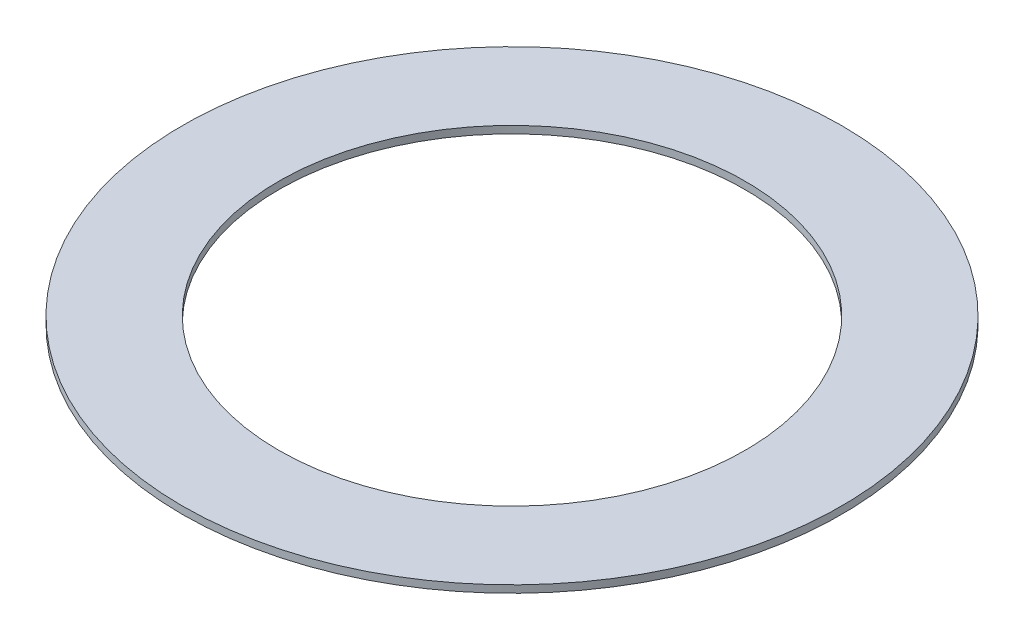
ISO-10303-21;
HEADER;
FILE_DESCRIPTION(('STEP AP214'),'2;1');
FILE_NAME('part.step','',(''),(''),'','','');
FILE_SCHEMA(('AUTOMOTIVE_DESIGN { 1 0 10303 214 1 1 1 1 }'));
ENDSEC;
DATA;
#1=APPLICATION_CONTEXT('core data for automotive mechanical design processes');
#2=APPLICATION_PROTOCOL_DEFINITION('international standard','automotive_design',2000,#1);
#3=PRODUCT_CONTEXT('',#1,'mechanical');
#4=PRODUCT('Part','Part','',(#3));
#5=PRODUCT_RELATED_PRODUCT_CATEGORY('part','',(#4));
#6=PRODUCT_DEFINITION_FORMATION('','',#4);
#7=PRODUCT_DEFINITION_CONTEXT('part definition',#1,'design');
#8=PRODUCT_DEFINITION('design','',#6,#7);
#9=PRODUCT_DEFINITION_SHAPE('','',#8);
#10=(LENGTH_UNIT() NAMED_UNIT(*) SI_UNIT(.MILLI.,.METRE.));
#11=(NAMED_UNIT(*) PLANE_ANGLE_UNIT() SI_UNIT($,.RADIAN.));
#12=(NAMED_UNIT(*) SI_UNIT($,.STERADIAN.) SOLID_ANGLE_UNIT());
#13=UNCERTAINTY_MEASURE_WITH_UNIT(LENGTH_MEASURE(1.E-05),#10,'distance_accuracy_value','');
#14=(GEOMETRIC_REPRESENTATION_CONTEXT(3) GLOBAL_UNCERTAINTY_ASSIGNED_CONTEXT((#13)) GLOBAL_UNIT_ASSIGNED_CONTEXT((#10,
#11,#12)) REPRESENTATION_CONTEXT('',''));
#15=CARTESIAN_POINT('',(0.,0.,0.));
#16=DIRECTION('',(0.,0.,1.));
#17=DIRECTION('',(1.,0.,0.));
#18=AXIS2_PLACEMENT_3D('',#15,#16,#17);
#19=CARTESIAN_POINT('',(0.,2.4,0.));
#20=DIRECTION('',(0.,1.,0.));
#21=DIRECTION('',(0.,0.,1.));
#22=AXIS2_PLACEMENT_3D('',#19,#20,#21);
#23=PLANE('',#22);
#24=CARTESIAN_POINT('',(0.,2.4,0.));
#25=DIRECTION('',(0.,1.,0.));
#26=DIRECTION('',(0.,0.,1.));
#27=AXIS2_PLACEMENT_3D('',#24,#25,#26);
#28=CIRCLE('',#27,107.696);
#29=CARTESIAN_POINT('',(0.,2.4,107.696));
#30=VERTEX_POINT('',#29);
#31=EDGE_CURVE('E10',#30,#30,#28,.T.);
#32=ORIENTED_EDGE('',*,*,#31,.T.);
#33=EDGE_LOOP('',(#32));
#34=FACE_BOUND('',#33,.T.);
#35=CARTESIAN_POINT('',(0.,2.4,0.));
#36=DIRECTION('',(0.,1.,0.));
#37=DIRECTION('',(0.,0.,1.));
#38=AXIS2_PLACEMENT_3D('',#35,#36,#37);
#39=CIRCLE('',#38,76.2);
#40=CARTESIAN_POINT('',(0.,2.4,76.2));
#41=VERTEX_POINT('',#40);
#42=EDGE_CURVE('E43',#41,#41,#39,.T.);
#43=ORIENTED_EDGE('',*,*,#42,.F.);
#44=EDGE_LOOP('',(#43));
#45=FACE_BOUND('',#44,.T.);
#46=ADVANCED_FACE('F32',(#34,#45),#23,.T.);
#47=CARTESIAN_POINT('',(0.,0.,0.));
#48=DIRECTION('',(0.,1.,0.));
#49=DIRECTION('',(0.,0.,1.));
#50=AXIS2_PLACEMENT_3D('',#47,#48,#49);
#51=PLANE('',#50);
#52=CARTESIAN_POINT('',(0.,0.,0.));
#53=DIRECTION('',(0.,1.,0.));
#54=DIRECTION('',(0.,0.,1.));
#55=AXIS2_PLACEMENT_3D('',#52,#53,#54);
#56=CIRCLE('',#55,107.696);
#57=CARTESIAN_POINT('',(0.,0.,107.696));
#58=VERTEX_POINT('',#57);
#59=EDGE_CURVE('E36',#58,#58,#56,.T.);
#60=ORIENTED_EDGE('',*,*,#59,.F.);
#61=EDGE_LOOP('',(#60));
#62=FACE_BOUND('',#61,.T.);
#63=CARTESIAN_POINT('',(0.,0.,0.));
#64=DIRECTION('',(0.,1.,0.));
#65=DIRECTION('',(0.,0.,1.));
#66=AXIS2_PLACEMENT_3D('',#63,#64,#65);
#67=CIRCLE('',#66,76.2);
#68=CARTESIAN_POINT('',(0.,0.,76.2));
#69=VERTEX_POINT('',#68);
#70=EDGE_CURVE('E45',#69,#69,#67,.T.);
#71=ORIENTED_EDGE('',*,*,#70,.T.);
#72=EDGE_LOOP('',(#71));
#73=FACE_BOUND('',#72,.T.);
#74=ADVANCED_FACE('F55',(#62,#73),#51,.F.);
#75=CARTESIAN_POINT('',(0.,2.4,0.));
#76=DIRECTION('',(0.,-1.,0.));
#77=DIRECTION('',(0.,0.,-1.));
#78=AXIS2_PLACEMENT_3D('',#75,#76,#77);
#79=CYLINDRICAL_SURFACE('',#78,107.696);
#80=ORIENTED_EDGE('',*,*,#31,.F.);
#81=EDGE_LOOP('',(#80));
#82=FACE_BOUND('',#81,.T.);
#83=ORIENTED_EDGE('',*,*,#59,.T.);
#84=EDGE_LOOP('',(#83));
#85=FACE_BOUND('',#84,.T.);
#86=ADVANCED_FACE('F34',(#82,#85),#79,.T.);
#87=CARTESIAN_POINT('',(0.,2.4,0.));
#88=DIRECTION('',(0.,-1.,0.));
#89=DIRECTION('',(0.,0.,-1.));
#90=AXIS2_PLACEMENT_3D('',#87,#88,#89);
#91=CYLINDRICAL_SURFACE('',#90,76.2);
#92=ORIENTED_EDGE('',*,*,#42,.T.);
#93=EDGE_LOOP('',(#92));
#94=FACE_BOUND('',#93,.T.);
#95=ORIENTED_EDGE('',*,*,#70,.F.);
#96=EDGE_LOOP('',(#95));
#97=FACE_BOUND('',#96,.T.);
#98=ADVANCED_FACE('F51',(#94,#97),#91,.F.);
#99=CLOSED_SHELL('',(#46,#74,#86,#98));
#100=MANIFOLD_SOLID_BREP('B2',#99);
#101=ADVANCED_BREP_SHAPE_REPRESENTATION('',(#18,#100),#14);
#102=SHAPE_DEFINITION_REPRESENTATION(#9,#101);
ENDSEC;
END-ISO-10303-21;
